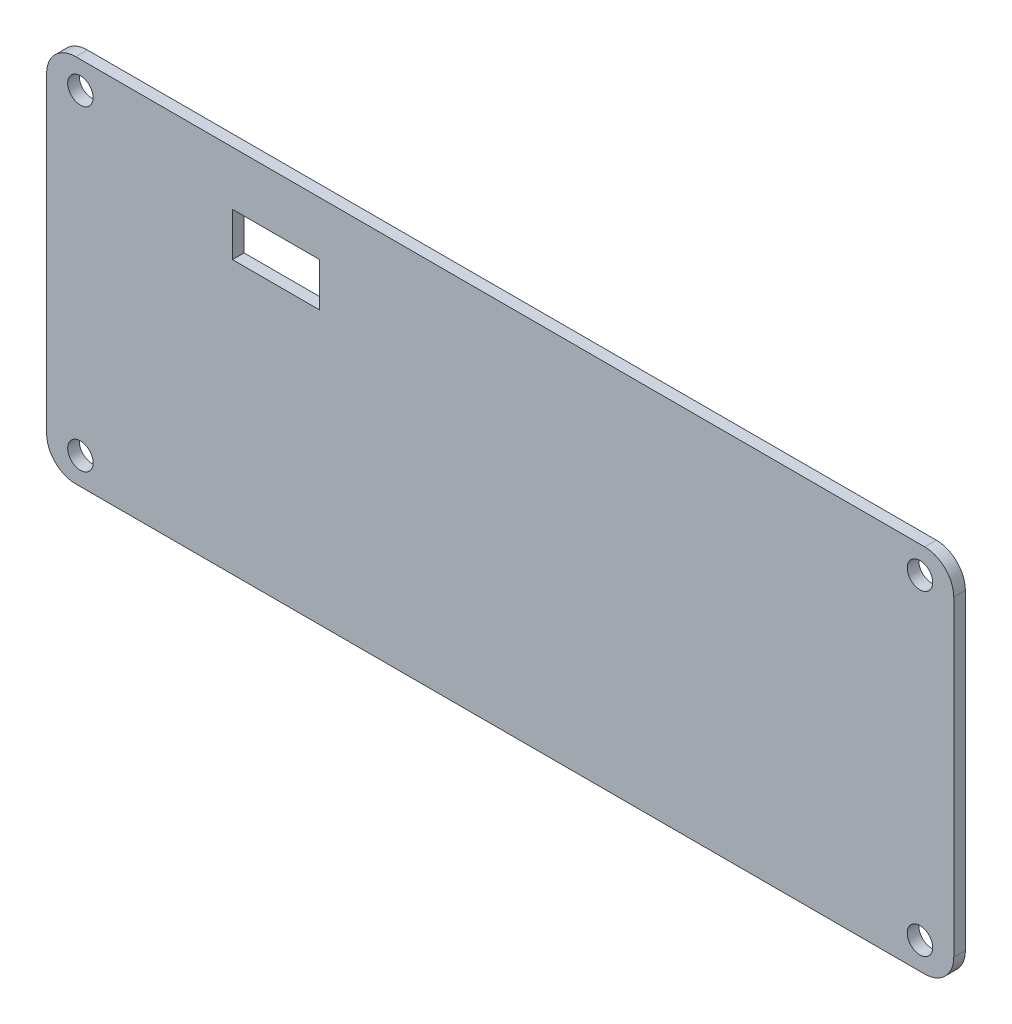
ISO-10303-21;
HEADER;
FILE_DESCRIPTION(('STEP AP214'),'2;1');
FILE_NAME('part.step','',(''),(''),'','','');
FILE_SCHEMA(('AUTOMOTIVE_DESIGN { 1 0 10303 214 1 1 1 1 }'));
ENDSEC;
DATA;
#1=APPLICATION_CONTEXT('core data for automotive mechanical design processes');
#2=APPLICATION_PROTOCOL_DEFINITION('international standard','automotive_design',2000,#1);
#3=PRODUCT_CONTEXT('',#1,'mechanical');
#4=PRODUCT('Part','Part','',(#3));
#5=PRODUCT_RELATED_PRODUCT_CATEGORY('part','',(#4));
#6=PRODUCT_DEFINITION_FORMATION('','',#4);
#7=PRODUCT_DEFINITION_CONTEXT('part definition',#1,'design');
#8=PRODUCT_DEFINITION('design','',#6,#7);
#9=PRODUCT_DEFINITION_SHAPE('','',#8);
#10=(LENGTH_UNIT() NAMED_UNIT(*) SI_UNIT(.MILLI.,.METRE.));
#11=(NAMED_UNIT(*) PLANE_ANGLE_UNIT() SI_UNIT($,.RADIAN.));
#12=(NAMED_UNIT(*) SI_UNIT($,.STERADIAN.) SOLID_ANGLE_UNIT());
#13=UNCERTAINTY_MEASURE_WITH_UNIT(LENGTH_MEASURE(1.E-05),#10,'distance_accuracy_value','');
#14=(GEOMETRIC_REPRESENTATION_CONTEXT(3) GLOBAL_UNCERTAINTY_ASSIGNED_CONTEXT((#13)) GLOBAL_UNIT_ASSIGNED_CONTEXT((#10,
#11,#12)) REPRESENTATION_CONTEXT('',''));
#15=CARTESIAN_POINT('',(0.,0.,0.));
#16=DIRECTION('',(0.,0.,1.));
#17=DIRECTION('',(1.,0.,0.));
#18=AXIS2_PLACEMENT_3D('',#15,#16,#17);
#19=CARTESIAN_POINT('',(120.15,-3.7,0.));
#20=DIRECTION('',(0.,0.,-1.));
#21=DIRECTION('',(1.,0.,0.));
#22=AXIS2_PLACEMENT_3D('',#19,#20,#21);
#23=CYLINDRICAL_SURFACE('',#22,1.75);
#24=CARTESIAN_POINT('',(120.15,-3.7,0.));
#25=DIRECTION('',(0.,0.,1.));
#26=DIRECTION('',(1.,0.,0.));
#27=AXIS2_PLACEMENT_3D('',#24,#25,#26);
#28=CIRCLE('',#27,1.75);
#29=CARTESIAN_POINT('',(121.9,-3.7,0.));
#30=VERTEX_POINT('',#29);
#31=EDGE_CURVE('E216',#30,#30,#28,.T.);
#32=ORIENTED_EDGE('',*,*,#31,.F.);
#33=DIRECTION('',(0.,0.,1.));
#34=VECTOR('',#33,1.);
#35=CARTESIAN_POINT('',(121.9,-3.7,0.));
#36=LINE('',#35,#34);
#37=CARTESIAN_POINT('',(121.9,-3.7,1.6));
#38=VERTEX_POINT('',#37);
#39=EDGE_CURVE('E10',#30,#38,#36,.T.);
#40=ORIENTED_EDGE('',*,*,#39,.T.);
#41=CARTESIAN_POINT('',(120.15,-3.7,1.6));
#42=DIRECTION('',(0.,0.,1.));
#43=DIRECTION('',(1.,0.,0.));
#44=AXIS2_PLACEMENT_3D('',#41,#42,#43);
#45=CIRCLE('',#44,1.75);
#46=EDGE_CURVE('E241',#38,#38,#45,.T.);
#47=ORIENTED_EDGE('',*,*,#46,.T.);
#48=ORIENTED_EDGE('',*,*,#39,.F.);
#49=EDGE_LOOP('',(#32,#40,#47,#48));
#50=FACE_BOUND('',#49,.T.);
#51=ADVANCED_FACE('F16',(#50),#23,.F.);
#52=CARTESIAN_POINT('',(4.65,-3.7,0.));
#53=DIRECTION('',(0.,0.,-1.));
#54=DIRECTION('',(1.,0.,0.));
#55=AXIS2_PLACEMENT_3D('',#52,#53,#54);
#56=CYLINDRICAL_SURFACE('',#55,1.75);
#57=CARTESIAN_POINT('',(4.65,-3.7,0.));
#58=DIRECTION('',(0.,0.,1.));
#59=DIRECTION('',(1.,0.,0.));
#60=AXIS2_PLACEMENT_3D('',#57,#58,#59);
#61=CIRCLE('',#60,1.75);
#62=CARTESIAN_POINT('',(6.4,-3.7,0.));
#63=VERTEX_POINT('',#62);
#64=EDGE_CURVE('E20',#63,#63,#61,.T.);
#65=ORIENTED_EDGE('',*,*,#64,.F.);
#66=DIRECTION('',(0.,0.,1.));
#67=VECTOR('',#66,1.);
#68=CARTESIAN_POINT('',(6.4,-3.7,0.));
#69=LINE('',#68,#67);
#70=CARTESIAN_POINT('',(6.4,-3.7,1.6));
#71=VERTEX_POINT('',#70);
#72=EDGE_CURVE('E27',#63,#71,#69,.T.);
#73=ORIENTED_EDGE('',*,*,#72,.T.);
#74=CARTESIAN_POINT('',(4.65,-3.7,1.6));
#75=DIRECTION('',(0.,0.,1.));
#76=DIRECTION('',(1.,0.,0.));
#77=AXIS2_PLACEMENT_3D('',#74,#75,#76);
#78=CIRCLE('',#77,1.75);
#79=EDGE_CURVE('E235',#71,#71,#78,.T.);
#80=ORIENTED_EDGE('',*,*,#79,.T.);
#81=ORIENTED_EDGE('',*,*,#72,.F.);
#82=EDGE_LOOP('',(#65,#73,#80,#81));
#83=FACE_BOUND('',#82,.T.);
#84=ADVANCED_FACE('F401',(#83),#56,.F.);
#85=CARTESIAN_POINT('',(37.565,-7.4,0.));
#86=DIRECTION('',(1.,0.,0.));
#87=DIRECTION('',(0.,1.,0.));
#88=AXIS2_PLACEMENT_3D('',#85,#86,#87);
#89=PLANE('',#88);
#90=DIRECTION('',(0.,-1.,0.));
#91=VECTOR('',#90,1.);
#92=CARTESIAN_POINT('',(37.565,-7.4,0.));
#93=LINE('',#92,#91);
#94=CARTESIAN_POINT('',(37.565,-7.4,0.));
#95=VERTEX_POINT('',#94);
#96=CARTESIAN_POINT('',(37.565,-13.4,0.));
#97=VERTEX_POINT('',#96);
#98=EDGE_CURVE('E230',#95,#97,#93,.T.);
#99=ORIENTED_EDGE('',*,*,#98,.T.);
#100=DIRECTION('',(0.,0.,1.));
#101=VECTOR('',#100,1.);
#102=CARTESIAN_POINT('',(37.565,-13.4,0.));
#103=LINE('',#102,#101);
#104=CARTESIAN_POINT('',(37.565,-13.4,1.6));
#105=VERTEX_POINT('',#104);
#106=EDGE_CURVE('E176',#97,#105,#103,.T.);
#107=ORIENTED_EDGE('',*,*,#106,.T.);
#108=DIRECTION('',(0.,-1.,0.));
#109=VECTOR('',#108,1.);
#110=CARTESIAN_POINT('',(37.565,-7.4,1.6));
#111=LINE('',#110,#109);
#112=CARTESIAN_POINT('',(37.565,-7.4,1.6));
#113=VERTEX_POINT('',#112);
#114=EDGE_CURVE('E174',#113,#105,#111,.T.);
#115=ORIENTED_EDGE('',*,*,#114,.F.);
#116=DIRECTION('',(0.,0.,1.));
#117=VECTOR('',#116,1.);
#118=CARTESIAN_POINT('',(37.565,-7.4,0.));
#119=LINE('',#118,#117);
#120=EDGE_CURVE('E158',#95,#113,#119,.T.);
#121=ORIENTED_EDGE('',*,*,#120,.F.);
#122=EDGE_LOOP('',(#99,#107,#115,#121));
#123=FACE_BOUND('',#122,.T.);
#124=ADVANCED_FACE('F175',(#123),#89,.F.);
#125=CARTESIAN_POINT('',(37.565,-13.4,0.));
#126=DIRECTION('',(0.,-1.,0.));
#127=DIRECTION('',(0.,0.,-1.));
#128=AXIS2_PLACEMENT_3D('',#125,#126,#127);
#129=PLANE('',#128);
#130=DIRECTION('',(-1.,0.,0.));
#131=VECTOR('',#130,1.);
#132=CARTESIAN_POINT('',(37.565,-13.4,0.));
#133=LINE('',#132,#131);
#134=CARTESIAN_POINT('',(25.565,-13.4,0.));
#135=VERTEX_POINT('',#134);
#136=EDGE_CURVE('E226',#97,#135,#133,.T.);
#137=ORIENTED_EDGE('',*,*,#136,.T.);
#138=DIRECTION('',(0.,0.,1.));
#139=VECTOR('',#138,1.);
#140=CARTESIAN_POINT('',(25.565,-13.4,0.));
#141=LINE('',#140,#139);
#142=CARTESIAN_POINT('',(25.565,-13.4,1.6));
#143=VERTEX_POINT('',#142);
#144=EDGE_CURVE('E253',#135,#143,#141,.T.);
#145=ORIENTED_EDGE('',*,*,#144,.T.);
#146=DIRECTION('',(-1.,0.,0.));
#147=VECTOR('',#146,1.);
#148=CARTESIAN_POINT('',(37.565,-13.4,1.6));
#149=LINE('',#148,#147);
#150=EDGE_CURVE('E181',#105,#143,#149,.T.);
#151=ORIENTED_EDGE('',*,*,#150,.F.);
#152=ORIENTED_EDGE('',*,*,#106,.F.);
#153=EDGE_LOOP('',(#137,#145,#151,#152));
#154=FACE_BOUND('',#153,.T.);
#155=ADVANCED_FACE('F339',(#154),#129,.F.);
#156=CARTESIAN_POINT('',(25.565,-13.4,0.));
#157=DIRECTION('',(-1.,0.,0.));
#158=DIRECTION('',(0.,0.,1.));
#159=AXIS2_PLACEMENT_3D('',#156,#157,#158);
#160=PLANE('',#159);
#161=DIRECTION('',(0.,1.,0.));
#162=VECTOR('',#161,1.);
#163=CARTESIAN_POINT('',(25.565,-13.4,0.));
#164=LINE('',#163,#162);
#165=CARTESIAN_POINT('',(25.565,-7.4,0.));
#166=VERTEX_POINT('',#165);
#167=EDGE_CURVE('E222',#135,#166,#164,.T.);
#168=ORIENTED_EDGE('',*,*,#167,.T.);
#169=DIRECTION('',(0.,0.,1.));
#170=VECTOR('',#169,1.);
#171=CARTESIAN_POINT('',(25.565,-7.4,0.));
#172=LINE('',#171,#170);
#173=CARTESIAN_POINT('',(25.565,-7.4,1.6));
#174=VERTEX_POINT('',#173);
#175=EDGE_CURVE('E170',#166,#174,#172,.T.);
#176=ORIENTED_EDGE('',*,*,#175,.T.);
#177=DIRECTION('',(0.,1.,0.));
#178=VECTOR('',#177,1.);
#179=CARTESIAN_POINT('',(25.565,-13.4,1.6));
#180=LINE('',#179,#178);
#181=EDGE_CURVE('E186',#143,#174,#180,.T.);
#182=ORIENTED_EDGE('',*,*,#181,.F.);
#183=ORIENTED_EDGE('',*,*,#144,.F.);
#184=EDGE_LOOP('',(#168,#176,#182,#183));
#185=FACE_BOUND('',#184,.T.);
#186=ADVANCED_FACE('F344',(#185),#160,.F.);
#187=CARTESIAN_POINT('',(25.565,-7.4,0.));
#188=DIRECTION('',(0.,1.,0.));
#189=DIRECTION('',(1.,0.,0.));
#190=AXIS2_PLACEMENT_3D('',#187,#188,#189);
#191=PLANE('',#190);
#192=DIRECTION('',(1.,0.,0.));
#193=VECTOR('',#192,1.);
#194=CARTESIAN_POINT('',(25.565,-7.4,0.));
#195=LINE('',#194,#193);
#196=EDGE_CURVE('E165',#166,#95,#195,.T.);
#197=ORIENTED_EDGE('',*,*,#196,.T.);
#198=ORIENTED_EDGE('',*,*,#120,.T.);
#199=DIRECTION('',(1.,0.,0.));
#200=VECTOR('',#199,1.);
#201=CARTESIAN_POINT('',(25.565,-7.4,1.6));
#202=LINE('',#201,#200);
#203=EDGE_CURVE('E162',#174,#113,#202,.T.);
#204=ORIENTED_EDGE('',*,*,#203,.F.);
#205=ORIENTED_EDGE('',*,*,#175,.F.);
#206=EDGE_LOOP('',(#197,#198,#204,#205));
#207=FACE_BOUND('',#206,.T.);
#208=ADVANCED_FACE('F160',(#207),#191,.F.);
#209=CARTESIAN_POINT('',(4.65,-47.2,0.));
#210=DIRECTION('',(0.,0.,-1.));
#211=DIRECTION('',(1.,0.,0.));
#212=AXIS2_PLACEMENT_3D('',#209,#210,#211);
#213=CYLINDRICAL_SURFACE('',#212,1.75);
#214=CARTESIAN_POINT('',(4.65,-47.2,0.));
#215=DIRECTION('',(0.,0.,1.));
#216=DIRECTION('',(1.,0.,0.));
#217=AXIS2_PLACEMENT_3D('',#214,#215,#216);
#218=CIRCLE('',#217,1.75);
#219=CARTESIAN_POINT('',(6.4,-47.2,0.));
#220=VERTEX_POINT('',#219);
#221=EDGE_CURVE('E227',#220,#220,#218,.T.);
#222=ORIENTED_EDGE('',*,*,#221,.F.);
#223=DIRECTION('',(0.,0.,1.));
#224=VECTOR('',#223,1.);
#225=CARTESIAN_POINT('',(6.4,-47.2,0.));
#226=LINE('',#225,#224);
#227=CARTESIAN_POINT('',(6.4,-47.2,1.6));
#228=VERTEX_POINT('',#227);
#229=EDGE_CURVE('E171',#220,#228,#226,.T.);
#230=ORIENTED_EDGE('',*,*,#229,.T.);
#231=CARTESIAN_POINT('',(4.65,-47.2,1.6));
#232=DIRECTION('',(0.,0.,1.));
#233=DIRECTION('',(1.,0.,0.));
#234=AXIS2_PLACEMENT_3D('',#231,#232,#233);
#235=CIRCLE('',#234,1.75);
#236=EDGE_CURVE('E240',#228,#228,#235,.T.);
#237=ORIENTED_EDGE('',*,*,#236,.T.);
#238=ORIENTED_EDGE('',*,*,#229,.F.);
#239=EDGE_LOOP('',(#222,#230,#237,#238));
#240=FACE_BOUND('',#239,.T.);
#241=ADVANCED_FACE('F415',(#240),#213,.F.);
#242=CARTESIAN_POINT('',(120.15,-47.2,0.));
#243=DIRECTION('',(0.,0.,-1.));
#244=DIRECTION('',(1.,0.,0.));
#245=AXIS2_PLACEMENT_3D('',#242,#243,#244);
#246=CYLINDRICAL_SURFACE('',#245,1.75);
#247=CARTESIAN_POINT('',(120.15,-47.2,0.));
#248=DIRECTION('',(0.,0.,1.));
#249=DIRECTION('',(1.,0.,0.));
#250=AXIS2_PLACEMENT_3D('',#247,#248,#249);
#251=CIRCLE('',#250,1.75);
#252=CARTESIAN_POINT('',(121.9,-47.2,0.));
#253=VERTEX_POINT('',#252);
#254=EDGE_CURVE('E264',#253,#253,#251,.T.);
#255=ORIENTED_EDGE('',*,*,#254,.F.);
#256=DIRECTION('',(0.,0.,1.));
#257=VECTOR('',#256,1.);
#258=CARTESIAN_POINT('',(121.9,-47.2,0.));
#259=LINE('',#258,#257);
#260=CARTESIAN_POINT('',(121.9,-47.2,1.6));
#261=VERTEX_POINT('',#260);
#262=EDGE_CURVE('E243',#253,#261,#259,.T.);
#263=ORIENTED_EDGE('',*,*,#262,.T.);
#264=CARTESIAN_POINT('',(120.15,-47.2,1.6));
#265=DIRECTION('',(0.,0.,1.));
#266=DIRECTION('',(1.,0.,0.));
#267=AXIS2_PLACEMENT_3D('',#264,#265,#266);
#268=CIRCLE('',#267,1.75);
#269=EDGE_CURVE('E236',#261,#261,#268,.T.);
#270=ORIENTED_EDGE('',*,*,#269,.T.);
#271=ORIENTED_EDGE('',*,*,#262,.F.);
#272=EDGE_LOOP('',(#255,#263,#270,#271));
#273=FACE_BOUND('',#272,.T.);
#274=ADVANCED_FACE('F417',(#273),#246,.F.);
#275=CARTESIAN_POINT('',(4.1,-50.9,0.));
#276=DIRECTION('',(0.,1.,0.));
#277=DIRECTION('',(1.,0.,0.));
#278=AXIS2_PLACEMENT_3D('',#275,#276,#277);
#279=PLANE('',#278);
#280=DIRECTION('',(1.,0.,0.));
#281=VECTOR('',#280,1.);
#282=CARTESIAN_POINT('',(4.1,-50.9,0.));
#283=LINE('',#282,#281);
#284=CARTESIAN_POINT('',(4.1,-50.9,0.));
#285=VERTEX_POINT('',#284);
#286=CARTESIAN_POINT('',(120.8,-50.9,0.));
#287=VERTEX_POINT('',#286);
#288=EDGE_CURVE('E200',#285,#287,#283,.T.);
#289=ORIENTED_EDGE('',*,*,#288,.T.);
#290=DIRECTION('',(0.,0.,1.));
#291=VECTOR('',#290,1.);
#292=CARTESIAN_POINT('',(120.8,-50.9,0.));
#293=LINE('',#292,#291);
#294=CARTESIAN_POINT('',(120.8,-50.9,1.6));
#295=VERTEX_POINT('',#294);
#296=EDGE_CURVE('E244',#287,#295,#293,.T.);
#297=ORIENTED_EDGE('',*,*,#296,.T.);
#298=DIRECTION('',(1.,0.,0.));
#299=VECTOR('',#298,1.);
#300=CARTESIAN_POINT('',(4.1,-50.9,1.6));
#301=LINE('',#300,#299);
#302=CARTESIAN_POINT('',(4.1,-50.9,1.6));
#303=VERTEX_POINT('',#302);
#304=EDGE_CURVE('E274',#303,#295,#301,.T.);
#305=ORIENTED_EDGE('',*,*,#304,.F.);
#306=DIRECTION('',(0.,0.,1.));
#307=VECTOR('',#306,1.);
#308=CARTESIAN_POINT('',(4.1,-50.9,0.));
#309=LINE('',#308,#307);
#310=EDGE_CURVE('E131',#285,#303,#309,.T.);
#311=ORIENTED_EDGE('',*,*,#310,.F.);
#312=EDGE_LOOP('',(#289,#297,#305,#311));
#313=FACE_BOUND('',#312,.T.);
#314=ADVANCED_FACE('F387',(#313),#279,.F.);
#315=CARTESIAN_POINT('',(4.,-46.9,0.));
#316=DIRECTION('',(0.,0.,-1.));
#317=DIRECTION('',(1.,0.,0.));
#318=AXIS2_PLACEMENT_3D('',#315,#316,#317);
#319=CYLINDRICAL_SURFACE('',#318,4.001249804749);
#320=CARTESIAN_POINT('',(4.,-46.9,0.));
#321=DIRECTION('',(0.,0.,1.));
#322=DIRECTION('',(1.,0.,0.));
#323=AXIS2_PLACEMENT_3D('',#320,#321,#322);
#324=CIRCLE('',#323,4.001249804749);
#325=CARTESIAN_POINT('',(0.,-47.,0.));
#326=VERTEX_POINT('',#325);
#327=EDGE_CURVE('E204',#326,#285,#324,.T.);
#328=ORIENTED_EDGE('',*,*,#327,.T.);
#329=ORIENTED_EDGE('',*,*,#310,.T.);
#330=CARTESIAN_POINT('',(4.,-46.9,1.6));
#331=DIRECTION('',(0.,0.,1.));
#332=DIRECTION('',(1.,0.,0.));
#333=AXIS2_PLACEMENT_3D('',#330,#331,#332);
#334=CIRCLE('',#333,4.001249804749);
#335=CARTESIAN_POINT('',(0.,-47.,1.6));
#336=VERTEX_POINT('',#335);
#337=EDGE_CURVE('E215',#336,#303,#334,.T.);
#338=ORIENTED_EDGE('',*,*,#337,.F.);
#339=DIRECTION('',(0.,0.,1.));
#340=VECTOR('',#339,1.);
#341=CARTESIAN_POINT('',(0.,-47.,0.));
#342=LINE('',#341,#340);
#343=EDGE_CURVE('E139',#326,#336,#342,.T.);
#344=ORIENTED_EDGE('',*,*,#343,.F.);
#345=EDGE_LOOP('',(#328,#329,#338,#344));
#346=FACE_BOUND('',#345,.T.);
#347=ADVANCED_FACE('F18',(#346),#319,.T.);
#348=CARTESIAN_POINT('',(120.8,-46.9,0.));
#349=DIRECTION('',(0.,0.,-1.));
#350=DIRECTION('',(1.,0.,0.));
#351=AXIS2_PLACEMENT_3D('',#348,#349,#350);
#352=CYLINDRICAL_SURFACE('',#351,4.);
#353=CARTESIAN_POINT('',(120.8,-46.9,0.));
#354=DIRECTION('',(0.,0.,1.));
#355=DIRECTION('',(1.,0.,0.));
#356=AXIS2_PLACEMENT_3D('',#353,#354,#355);
#357=CIRCLE('',#356,4.);
#358=CARTESIAN_POINT('',(124.8,-46.9,0.));
#359=VERTEX_POINT('',#358);
#360=EDGE_CURVE('E205',#287,#359,#357,.T.);
#361=ORIENTED_EDGE('',*,*,#360,.T.);
#362=DIRECTION('',(0.,0.,1.));
#363=VECTOR('',#362,1.);
#364=CARTESIAN_POINT('',(124.8,-46.9,0.));
#365=LINE('',#364,#363);
#366=CARTESIAN_POINT('',(124.8,-46.9,1.6));
#367=VERTEX_POINT('',#366);
#368=EDGE_CURVE('E231',#359,#367,#365,.T.);
#369=ORIENTED_EDGE('',*,*,#368,.T.);
#370=CARTESIAN_POINT('',(120.8,-46.9,1.6));
#371=DIRECTION('',(0.,0.,1.));
#372=DIRECTION('',(1.,0.,0.));
#373=AXIS2_PLACEMENT_3D('',#370,#371,#372);
#374=CIRCLE('',#373,4.);
#375=EDGE_CURVE('E306',#295,#367,#374,.T.);
#376=ORIENTED_EDGE('',*,*,#375,.F.);
#377=ORIENTED_EDGE('',*,*,#296,.F.);
#378=EDGE_LOOP('',(#361,#369,#376,#377));
#379=FACE_BOUND('',#378,.T.);
#380=ADVANCED_FACE('F385',(#379),#352,.T.);
#381=CARTESIAN_POINT('',(0.,-4.,0.));
#382=DIRECTION('',(1.,0.,0.));
#383=DIRECTION('',(0.,1.,0.));
#384=AXIS2_PLACEMENT_3D('',#381,#382,#383);
#385=PLANE('',#384);
#386=DIRECTION('',(0.,-1.,0.));
#387=VECTOR('',#386,1.);
#388=CARTESIAN_POINT('',(0.,-4.,0.));
#389=LINE('',#388,#387);
#390=CARTESIAN_POINT('',(0.,-4.,0.));
#391=VERTEX_POINT('',#390);
#392=EDGE_CURVE('E268',#391,#326,#389,.T.);
#393=ORIENTED_EDGE('',*,*,#392,.T.);
#394=ORIENTED_EDGE('',*,*,#343,.T.);
#395=DIRECTION('',(0.,-1.,0.));
#396=VECTOR('',#395,1.);
#397=CARTESIAN_POINT('',(0.,-4.,1.6));
#398=LINE('',#397,#396);
#399=CARTESIAN_POINT('',(0.,-4.,1.6));
#400=VERTEX_POINT('',#399);
#401=EDGE_CURVE('E212',#400,#336,#398,.T.);
#402=ORIENTED_EDGE('',*,*,#401,.F.);
#403=DIRECTION('',(0.,0.,1.));
#404=VECTOR('',#403,1.);
#405=CARTESIAN_POINT('',(0.,-4.,0.));
#406=LINE('',#405,#404);
#407=EDGE_CURVE('E287',#391,#400,#406,.T.);
#408=ORIENTED_EDGE('',*,*,#407,.F.);
#409=EDGE_LOOP('',(#393,#394,#402,#408));
#410=FACE_BOUND('',#409,.T.);
#411=ADVANCED_FACE('F388',(#410),#385,.F.);
#412=CARTESIAN_POINT('',(124.8,-46.9,0.));
#413=DIRECTION('',(-1.,0.,0.));
#414=DIRECTION('',(0.,0.,1.));
#415=AXIS2_PLACEMENT_3D('',#412,#413,#414);
#416=PLANE('',#415);
#417=DIRECTION('',(0.,1.,0.));
#418=VECTOR('',#417,1.);
#419=CARTESIAN_POINT('',(124.8,-46.9,0.));
#420=LINE('',#419,#418);
#421=CARTESIAN_POINT('',(124.8,-4.,0.));
#422=VERTEX_POINT('',#421);
#423=EDGE_CURVE('E218',#359,#422,#420,.T.);
#424=ORIENTED_EDGE('',*,*,#423,.T.);
#425=DIRECTION('',(0.,0.,1.));
#426=VECTOR('',#425,1.);
#427=CARTESIAN_POINT('',(124.8,-4.,0.));
#428=LINE('',#427,#426);
#429=CARTESIAN_POINT('',(124.8,-4.,1.6));
#430=VERTEX_POINT('',#429);
#431=EDGE_CURVE('E260',#422,#430,#428,.T.);
#432=ORIENTED_EDGE('',*,*,#431,.T.);
#433=DIRECTION('',(0.,1.,0.));
#434=VECTOR('',#433,1.);
#435=CARTESIAN_POINT('',(124.8,-46.9,1.6));
#436=LINE('',#435,#434);
#437=EDGE_CURVE('E192',#367,#430,#436,.T.);
#438=ORIENTED_EDGE('',*,*,#437,.F.);
#439=ORIENTED_EDGE('',*,*,#368,.F.);
#440=EDGE_LOOP('',(#424,#432,#438,#439));
#441=FACE_BOUND('',#440,.T.);
#442=ADVANCED_FACE('F381',(#441),#416,.F.);
#443=CARTESIAN_POINT('',(62.399602953014,-25.45011024283,1.6));
#444=DIRECTION('',(0.,0.,1.));
#445=DIRECTION('',(1.,0.,0.));
#446=AXIS2_PLACEMENT_3D('',#443,#444,#445);
#447=PLANE('',#446);
#448=ORIENTED_EDGE('',*,*,#79,.F.);
#449=EDGE_LOOP('',(#448));
#450=FACE_BOUND('',#449,.T.);
#451=ORIENTED_EDGE('',*,*,#236,.F.);
#452=EDGE_LOOP('',(#451));
#453=FACE_BOUND('',#452,.T.);
#454=ORIENTED_EDGE('',*,*,#269,.F.);
#455=EDGE_LOOP('',(#454));
#456=FACE_BOUND('',#455,.T.);
#457=ORIENTED_EDGE('',*,*,#46,.F.);
#458=EDGE_LOOP('',(#457));
#459=FACE_BOUND('',#458,.T.);
#460=ORIENTED_EDGE('',*,*,#181,.T.);
#461=ORIENTED_EDGE('',*,*,#203,.T.);
#462=ORIENTED_EDGE('',*,*,#114,.T.);
#463=ORIENTED_EDGE('',*,*,#150,.T.);
#464=EDGE_LOOP('',(#460,#461,#462,#463));
#465=FACE_BOUND('',#464,.T.);
#466=DIRECTION('',(-1.,0.,0.));
#467=VECTOR('',#466,1.);
#468=CARTESIAN_POINT('',(120.8,0.,1.6));
#469=LINE('',#468,#467);
#470=CARTESIAN_POINT('',(120.8,0.,1.6));
#471=VERTEX_POINT('',#470);
#472=CARTESIAN_POINT('',(4.,0.,1.6));
#473=VERTEX_POINT('',#472);
#474=EDGE_CURVE('E198',#471,#473,#469,.T.);
#475=ORIENTED_EDGE('',*,*,#474,.T.);
#476=CARTESIAN_POINT('',(4.,-4.,1.6));
#477=DIRECTION('',(0.,0.,1.));
#478=DIRECTION('',(1.,0.,0.));
#479=AXIS2_PLACEMENT_3D('',#476,#477,#478);
#480=CIRCLE('',#479,4.);
#481=EDGE_CURVE('E221',#473,#400,#480,.T.);
#482=ORIENTED_EDGE('',*,*,#481,.T.);
#483=ORIENTED_EDGE('',*,*,#401,.T.);
#484=ORIENTED_EDGE('',*,*,#337,.T.);
#485=ORIENTED_EDGE('',*,*,#304,.T.);
#486=ORIENTED_EDGE('',*,*,#375,.T.);
#487=ORIENTED_EDGE('',*,*,#437,.T.);
#488=CARTESIAN_POINT('',(120.8,-4.,1.6));
#489=DIRECTION('',(0.,0.,1.));
#490=DIRECTION('',(1.,0.,0.));
#491=AXIS2_PLACEMENT_3D('',#488,#489,#490);
#492=CIRCLE('',#491,4.);
#493=EDGE_CURVE('E210',#430,#471,#492,.T.);
#494=ORIENTED_EDGE('',*,*,#493,.T.);
#495=EDGE_LOOP('',(#475,#482,#483,#484,#485,#486,#487,#494));
#496=FACE_BOUND('',#495,.T.);
#497=ADVANCED_FACE('F183',(#450,#453,#456,#459,#465,#496),#447,.T.);
#498=CARTESIAN_POINT('',(62.399602953014,-25.45011024283,0.));
#499=DIRECTION('',(0.,0.,1.));
#500=DIRECTION('',(1.,0.,0.));
#501=AXIS2_PLACEMENT_3D('',#498,#499,#500);
#502=PLANE('',#501);
#503=ORIENTED_EDGE('',*,*,#31,.T.);
#504=EDGE_LOOP('',(#503));
#505=FACE_BOUND('',#504,.T.);
#506=ORIENTED_EDGE('',*,*,#64,.T.);
#507=EDGE_LOOP('',(#506));
#508=FACE_BOUND('',#507,.T.);
#509=ORIENTED_EDGE('',*,*,#167,.F.);
#510=ORIENTED_EDGE('',*,*,#136,.F.);
#511=ORIENTED_EDGE('',*,*,#98,.F.);
#512=ORIENTED_EDGE('',*,*,#196,.F.);
#513=EDGE_LOOP('',(#509,#510,#511,#512));
#514=FACE_BOUND('',#513,.T.);
#515=ORIENTED_EDGE('',*,*,#221,.T.);
#516=EDGE_LOOP('',(#515));
#517=FACE_BOUND('',#516,.T.);
#518=ORIENTED_EDGE('',*,*,#254,.T.);
#519=EDGE_LOOP('',(#518));
#520=FACE_BOUND('',#519,.T.);
#521=CARTESIAN_POINT('',(120.8,-4.,0.));
#522=DIRECTION('',(0.,0.,1.));
#523=DIRECTION('',(1.,0.,0.));
#524=AXIS2_PLACEMENT_3D('',#521,#522,#523);
#525=CIRCLE('',#524,4.);
#526=CARTESIAN_POINT('',(120.8,0.,0.));
#527=VERTEX_POINT('',#526);
#528=EDGE_CURVE('E206',#422,#527,#525,.T.);
#529=ORIENTED_EDGE('',*,*,#528,.F.);
#530=ORIENTED_EDGE('',*,*,#423,.F.);
#531=ORIENTED_EDGE('',*,*,#360,.F.);
#532=ORIENTED_EDGE('',*,*,#288,.F.);
#533=ORIENTED_EDGE('',*,*,#327,.F.);
#534=ORIENTED_EDGE('',*,*,#392,.F.);
#535=CARTESIAN_POINT('',(4.,-4.,0.));
#536=DIRECTION('',(0.,0.,1.));
#537=DIRECTION('',(1.,0.,0.));
#538=AXIS2_PLACEMENT_3D('',#535,#536,#537);
#539=CIRCLE('',#538,4.);
#540=CARTESIAN_POINT('',(4.,0.,0.));
#541=VERTEX_POINT('',#540);
#542=EDGE_CURVE('E279',#541,#391,#539,.T.);
#543=ORIENTED_EDGE('',*,*,#542,.F.);
#544=DIRECTION('',(-1.,0.,0.));
#545=VECTOR('',#544,1.);
#546=CARTESIAN_POINT('',(120.8,0.,0.));
#547=LINE('',#546,#545);
#548=EDGE_CURVE('E199',#527,#541,#547,.T.);
#549=ORIENTED_EDGE('',*,*,#548,.F.);
#550=EDGE_LOOP('',(#529,#530,#531,#532,#533,#534,#543,#549));
#551=FACE_BOUND('',#550,.T.);
#552=ADVANCED_FACE('F341',(#505,#508,#514,#517,#520,#551),#502,.F.);
#553=CARTESIAN_POINT('',(4.,-4.,0.));
#554=DIRECTION('',(0.,0.,-1.));
#555=DIRECTION('',(1.,0.,0.));
#556=AXIS2_PLACEMENT_3D('',#553,#554,#555);
#557=CYLINDRICAL_SURFACE('',#556,4.);
#558=ORIENTED_EDGE('',*,*,#542,.T.);
#559=ORIENTED_EDGE('',*,*,#407,.T.);
#560=ORIENTED_EDGE('',*,*,#481,.F.);
#561=DIRECTION('',(0.,0.,1.));
#562=VECTOR('',#561,1.);
#563=CARTESIAN_POINT('',(4.,0.,0.));
#564=LINE('',#563,#562);
#565=EDGE_CURVE('E195',#541,#473,#564,.T.);
#566=ORIENTED_EDGE('',*,*,#565,.F.);
#567=EDGE_LOOP('',(#558,#559,#560,#566));
#568=FACE_BOUND('',#567,.T.);
#569=ADVANCED_FACE('F377',(#568),#557,.T.);
#570=CARTESIAN_POINT('',(120.8,-4.,0.));
#571=DIRECTION('',(0.,0.,-1.));
#572=DIRECTION('',(1.,0.,0.));
#573=AXIS2_PLACEMENT_3D('',#570,#571,#572);
#574=CYLINDRICAL_SURFACE('',#573,4.);
#575=ORIENTED_EDGE('',*,*,#528,.T.);
#576=DIRECTION('',(0.,0.,1.));
#577=VECTOR('',#576,1.);
#578=CARTESIAN_POINT('',(120.8,0.,0.));
#579=LINE('',#578,#577);
#580=EDGE_CURVE('E211',#527,#471,#579,.T.);
#581=ORIENTED_EDGE('',*,*,#580,.T.);
#582=ORIENTED_EDGE('',*,*,#493,.F.);
#583=ORIENTED_EDGE('',*,*,#431,.F.);
#584=EDGE_LOOP('',(#575,#581,#582,#583));
#585=FACE_BOUND('',#584,.T.);
#586=ADVANCED_FACE('F365',(#585),#574,.T.);
#587=CARTESIAN_POINT('',(120.8,0.,0.));
#588=DIRECTION('',(0.,-1.,0.));
#589=DIRECTION('',(0.,0.,-1.));
#590=AXIS2_PLACEMENT_3D('',#587,#588,#589);
#591=PLANE('',#590);
#592=ORIENTED_EDGE('',*,*,#548,.T.);
#593=ORIENTED_EDGE('',*,*,#565,.T.);
#594=ORIENTED_EDGE('',*,*,#474,.F.);
#595=ORIENTED_EDGE('',*,*,#580,.F.);
#596=EDGE_LOOP('',(#592,#593,#594,#595));
#597=FACE_BOUND('',#596,.T.);
#598=ADVANCED_FACE('F372',(#597),#591,.F.);
#599=CLOSED_SHELL('',(#51,#84,#124,#155,#186,#208,#241,#274,#314,#347,#380,#411,#442,#497,#552,
#569,#586,#598));
#600=MANIFOLD_SOLID_BREP('B1',#599);
#601=ADVANCED_BREP_SHAPE_REPRESENTATION('',(#18,#600),#14);
#602=SHAPE_DEFINITION_REPRESENTATION(#9,#601);
ENDSEC;
END-ISO-10303-21;
